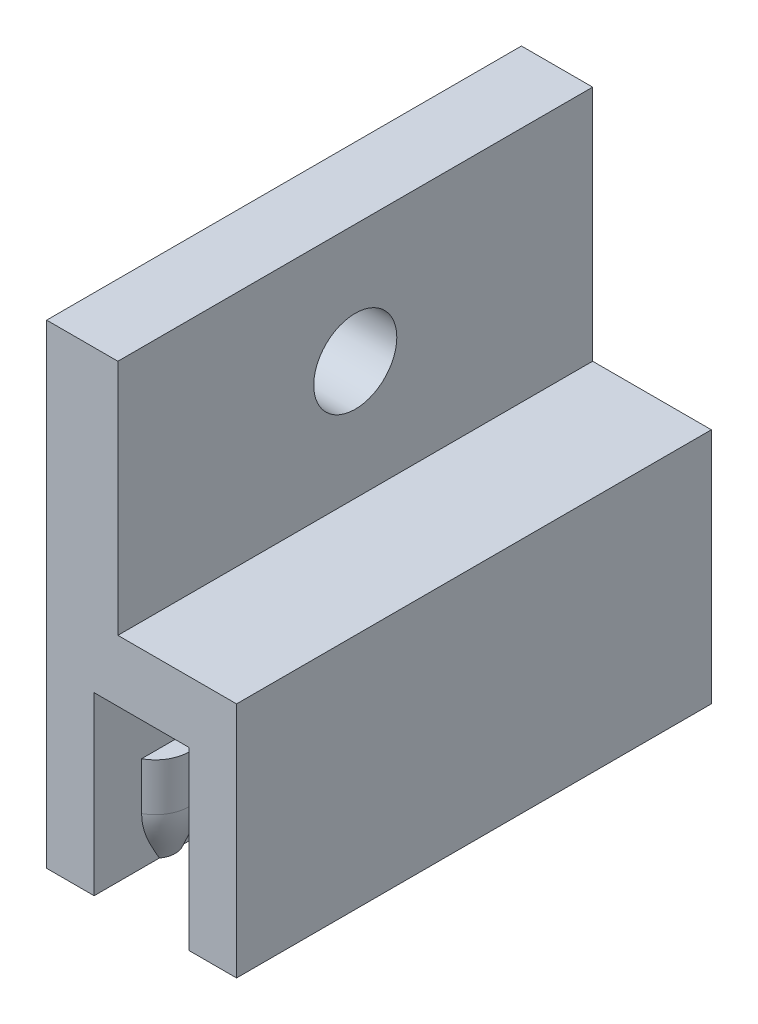
ISO-10303-21;
HEADER;
FILE_DESCRIPTION(('STEP AP214'),'2;1');
FILE_NAME('part.step','',(''),(''),'','','');
FILE_SCHEMA(('AUTOMOTIVE_DESIGN { 1 0 10303 214 1 1 1 1 }'));
ENDSEC;
DATA;
#1=APPLICATION_CONTEXT('core data for automotive mechanical design processes');
#2=APPLICATION_PROTOCOL_DEFINITION('international standard','automotive_design',2000,#1);
#3=PRODUCT_CONTEXT('',#1,'mechanical');
#4=PRODUCT('Part','Part','',(#3));
#5=PRODUCT_RELATED_PRODUCT_CATEGORY('part','',(#4));
#6=PRODUCT_DEFINITION_FORMATION('','',#4);
#7=PRODUCT_DEFINITION_CONTEXT('part definition',#1,'design');
#8=PRODUCT_DEFINITION('design','',#6,#7);
#9=PRODUCT_DEFINITION_SHAPE('','',#8);
#10=(LENGTH_UNIT() NAMED_UNIT(*) SI_UNIT(.MILLI.,.METRE.));
#11=(NAMED_UNIT(*) PLANE_ANGLE_UNIT() SI_UNIT($,.RADIAN.));
#12=(NAMED_UNIT(*) SI_UNIT($,.STERADIAN.) SOLID_ANGLE_UNIT());
#13=UNCERTAINTY_MEASURE_WITH_UNIT(LENGTH_MEASURE(1.E-05),#10,'distance_accuracy_value','');
#14=(GEOMETRIC_REPRESENTATION_CONTEXT(3) GLOBAL_UNCERTAINTY_ASSIGNED_CONTEXT((#13)) GLOBAL_UNIT_ASSIGNED_CONTEXT((#10,
#11,#12)) REPRESENTATION_CONTEXT('',''));
#15=CARTESIAN_POINT('',(0.,0.,0.));
#16=DIRECTION('',(0.,0.,1.));
#17=DIRECTION('',(1.,0.,0.));
#18=AXIS2_PLACEMENT_3D('',#15,#16,#17);
#19=CARTESIAN_POINT('',(0.,0.,20.));
#20=DIRECTION('',(-1.,0.,0.));
#21=DIRECTION('',(0.,0.,1.));
#22=AXIS2_PLACEMENT_3D('',#19,#20,#21);
#23=PLANE('',#22);
#24=DIRECTION('',(0.,1.,0.));
#25=VECTOR('',#24,1.);
#26=CARTESIAN_POINT('',(0.,0.,0.));
#27=LINE('',#26,#25);
#28=CARTESIAN_POINT('',(0.,0.,0.));
#29=VERTEX_POINT('',#28);
#30=CARTESIAN_POINT('',(0.,7.40971508067067,0.));
#31=VERTEX_POINT('',#30);
#32=EDGE_CURVE('E251',#29,#31,#27,.T.);
#33=ORIENTED_EDGE('',*,*,#32,.T.);
#34=CARTESIAN_POINT('',(0.,-77.,10.));
#35=DIRECTION('',(-1.,0.,0.));
#36=DIRECTION('',(0.,0.,1.));
#37=AXIS2_PLACEMENT_3D('',#34,#35,#36);
#38=CIRCLE('',#37,85.);
#39=CARTESIAN_POINT('',(0.,7.40971508067067,20.));
#40=VERTEX_POINT('',#39);
#41=EDGE_CURVE('E185',#40,#31,#38,.T.);
#42=ORIENTED_EDGE('',*,*,#41,.F.);
#43=DIRECTION('',(0.,1.,0.));
#44=VECTOR('',#43,1.);
#45=CARTESIAN_POINT('',(0.,0.,20.));
#46=LINE('',#45,#44);
#47=CARTESIAN_POINT('',(0.,0.,20.));
#48=VERTEX_POINT('',#47);
#49=EDGE_CURVE('E202',#48,#40,#46,.T.);
#50=ORIENTED_EDGE('',*,*,#49,.F.);
#51=DIRECTION('',(0.,0.,-1.));
#52=VECTOR('',#51,1.);
#53=CARTESIAN_POINT('',(0.,0.,20.));
#54=LINE('',#53,#52);
#55=CARTESIAN_POINT('',(0.,0.,17.25));
#56=VERTEX_POINT('',#55);
#57=EDGE_CURVE('E240',#48,#56,#54,.T.);
#58=ORIENTED_EDGE('',*,*,#57,.T.);
#59=CARTESIAN_POINT('',(0.,2.,18.));
#60=CARTESIAN_POINT('',(0.,1.28799968789021,18.));
#61=CARTESIAN_POINT('',(0.,0.643999843945103,17.625));
#62=CARTESIAN_POINT('',(0.,0.,17.25));
#63=B_SPLINE_CURVE_WITH_KNOTS('',3,(#59,#60,#61,#62),.UNSPECIFIED.,.F.,.F.,(4,4),(0.,1.),.UNSPECIFIED.);
#64=CARTESIAN_POINT('',(0.,2.,18.));
#65=VERTEX_POINT('',#64);
#66=EDGE_CURVE('E345',#65,#56,#63,.T.);
#67=ORIENTED_EDGE('',*,*,#66,.F.);
#68=DIRECTION('',(0.,-1.,0.));
#69=VECTOR('',#68,1.);
#70=CARTESIAN_POINT('',(0.,4.,18.));
#71=LINE('',#70,#69);
#72=CARTESIAN_POINT('',(0.,4.,18.));
#73=VERTEX_POINT('',#72);
#74=EDGE_CURVE('E262',#73,#65,#71,.T.);
#75=ORIENTED_EDGE('',*,*,#74,.F.);
#76=DIRECTION('',(0.,0.,-1.));
#77=VECTOR('',#76,1.);
#78=CARTESIAN_POINT('',(0.,4.,18.));
#79=LINE('',#78,#77);
#80=CARTESIAN_POINT('',(0.,4.,15.5));
#81=VERTEX_POINT('',#80);
#82=EDGE_CURVE('E266',#73,#81,#79,.T.);
#83=ORIENTED_EDGE('',*,*,#82,.T.);
#84=DIRECTION('',(0.,-1.,0.));
#85=VECTOR('',#84,1.);
#86=CARTESIAN_POINT('',(0.,4.,15.5));
#87=LINE('',#86,#85);
#88=CARTESIAN_POINT('',(0.,2.,15.5));
#89=VERTEX_POINT('',#88);
#90=EDGE_CURVE('E265',#81,#89,#87,.T.);
#91=ORIENTED_EDGE('',*,*,#90,.T.);
#92=CARTESIAN_POINT('',(0.,0.,16.25));
#93=CARTESIAN_POINT('',(0.,0.643999843945103,15.875));
#94=CARTESIAN_POINT('',(0.,1.28799968789021,15.5));
#95=CARTESIAN_POINT('',(0.,2.,15.5));
#96=B_SPLINE_CURVE_WITH_KNOTS('',3,(#92,#93,#94,#95),.UNSPECIFIED.,.F.,.F.,(4,4),(0.,1.),.UNSPECIFIED.);
#97=CARTESIAN_POINT('',(0.,0.,16.25));
#98=VERTEX_POINT('',#97);
#99=EDGE_CURVE('E347',#98,#89,#96,.T.);
#100=ORIENTED_EDGE('',*,*,#99,.F.);
#101=CARTESIAN_POINT('',(0.,0.,3.75));
#102=VERTEX_POINT('',#101);
#103=EDGE_CURVE('E235',#98,#102,#54,.T.);
#104=ORIENTED_EDGE('',*,*,#103,.T.);
#105=CARTESIAN_POINT('',(0.,2.,4.5));
#106=CARTESIAN_POINT('',(0.,1.28799968789021,4.5));
#107=CARTESIAN_POINT('',(0.,0.643999843945103,4.125));
#108=CARTESIAN_POINT('',(0.,0.,3.75));
#109=B_SPLINE_CURVE_WITH_KNOTS('',3,(#105,#106,#107,#108),.UNSPECIFIED.,.F.,.F.,(4,4),(0.,1.),.UNSPECIFIED.);
#110=CARTESIAN_POINT('',(0.,2.,4.5));
#111=VERTEX_POINT('',#110);
#112=EDGE_CURVE('E178',#111,#102,#109,.T.);
#113=ORIENTED_EDGE('',*,*,#112,.F.);
#114=DIRECTION('',(0.,-1.,0.));
#115=VECTOR('',#114,1.);
#116=CARTESIAN_POINT('',(0.,4.,4.5));
#117=LINE('',#116,#115);
#118=CARTESIAN_POINT('',(0.,4.,4.5));
#119=VERTEX_POINT('',#118);
#120=EDGE_CURVE('E415',#119,#111,#117,.T.);
#121=ORIENTED_EDGE('',*,*,#120,.F.);
#122=DIRECTION('',(0.,0.,-1.));
#123=VECTOR('',#122,1.);
#124=CARTESIAN_POINT('',(0.,4.,2.));
#125=LINE('',#124,#123);
#126=CARTESIAN_POINT('',(0.,4.,2.));
#127=VERTEX_POINT('',#126);
#128=EDGE_CURVE('E411',#119,#127,#125,.T.);
#129=ORIENTED_EDGE('',*,*,#128,.T.);
#130=DIRECTION('',(0.,-1.,0.));
#131=VECTOR('',#130,1.);
#132=CARTESIAN_POINT('',(0.,4.,2.));
#133=LINE('',#132,#131);
#134=CARTESIAN_POINT('',(0.,2.,2.));
#135=VERTEX_POINT('',#134);
#136=EDGE_CURVE('E511',#127,#135,#133,.T.);
#137=ORIENTED_EDGE('',*,*,#136,.T.);
#138=CARTESIAN_POINT('',(0.,0.,2.75));
#139=CARTESIAN_POINT('',(0.,0.643999843945103,2.375));
#140=CARTESIAN_POINT('',(0.,1.28799968789021,2.));
#141=CARTESIAN_POINT('',(0.,2.,2.));
#142=B_SPLINE_CURVE_WITH_KNOTS('',3,(#138,#139,#140,#141),.UNSPECIFIED.,.F.,.F.,(4,4),(0.,1.),.UNSPECIFIED.);
#143=CARTESIAN_POINT('',(0.,0.,2.75));
#144=VERTEX_POINT('',#143);
#145=EDGE_CURVE('E346',#144,#135,#142,.T.);
#146=ORIENTED_EDGE('',*,*,#145,.F.);
#147=EDGE_CURVE('E232',#144,#29,#54,.T.);
#148=ORIENTED_EDGE('',*,*,#147,.T.);
#149=EDGE_LOOP('',(#33,#42,#50,#58,#67,#75,#83,#91,#100,#104,#113,#121,#129,#137,#146,#148));
#150=FACE_BOUND('',#149,.T.);
#151=ADVANCED_FACE('F51',(#150),#23,.F.);
#152=CARTESIAN_POINT('',(4.,8.,20.));
#153=DIRECTION('',(1.,0.,0.));
#154=DIRECTION('',(0.,1.,0.));
#155=AXIS2_PLACEMENT_3D('',#152,#153,#154);
#156=PLANE('',#155);
#157=CARTESIAN_POINT('',(4.0000000000191,-77.,10.));
#158=DIRECTION('',(1.,0.,0.));
#159=DIRECTION('',(0.,1.,0.));
#160=AXIS2_PLACEMENT_3D('',#157,#158,#159);
#161=CIRCLE('',#160,85.);
#162=CARTESIAN_POINT('',(4.00000000013279,7.40971508067067,20.));
#163=VERTEX_POINT('',#162);
#164=CARTESIAN_POINT('',(4.00000000013279,7.40971508067067,0.));
#165=VERTEX_POINT('',#164);
#166=EDGE_CURVE('E170',#163,#165,#161,.F.);
#167=ORIENTED_EDGE('',*,*,#166,.T.);
#168=DIRECTION('',(0.,-1.,0.));
#169=VECTOR('',#168,1.);
#170=CARTESIAN_POINT('',(4.,8.,0.));
#171=LINE('',#170,#169);
#172=CARTESIAN_POINT('',(4.,0.,0.));
#173=VERTEX_POINT('',#172);
#174=EDGE_CURVE('E174',#165,#173,#171,.T.);
#175=ORIENTED_EDGE('',*,*,#174,.T.);
#176=DIRECTION('',(0.,0.,-1.));
#177=VECTOR('',#176,1.);
#178=CARTESIAN_POINT('',(4.,0.,20.));
#179=LINE('',#178,#177);
#180=CARTESIAN_POINT('',(4.,0.,20.));
#181=VERTEX_POINT('',#180);
#182=EDGE_CURVE('E12',#181,#173,#179,.T.);
#183=ORIENTED_EDGE('',*,*,#182,.F.);
#184=DIRECTION('',(0.,-1.,0.));
#185=VECTOR('',#184,1.);
#186=CARTESIAN_POINT('',(4.,8.,20.));
#187=LINE('',#186,#185);
#188=EDGE_CURVE('E175',#163,#181,#187,.T.);
#189=ORIENTED_EDGE('',*,*,#188,.F.);
#190=EDGE_LOOP('',(#167,#175,#183,#189));
#191=FACE_BOUND('',#190,.T.);
#192=ADVANCED_FACE('F53',(#191),#156,.F.);
#193=CARTESIAN_POINT('',(6.,0.,20.));
#194=DIRECTION('',(0.,-1.,0.));
#195=DIRECTION('',(0.,0.,-1.));
#196=AXIS2_PLACEMENT_3D('',#193,#194,#195);
#197=PLANE('',#196);
#198=DIRECTION('',(-1.,0.,0.));
#199=VECTOR('',#198,1.);
#200=CARTESIAN_POINT('',(6.,0.,0.));
#201=LINE('',#200,#199);
#202=CARTESIAN_POINT('',(6.,0.,0.));
#203=VERTEX_POINT('',#202);
#204=EDGE_CURVE('E194',#203,#173,#201,.T.);
#205=ORIENTED_EDGE('',*,*,#204,.F.);
#206=DIRECTION('',(0.,0.,-1.));
#207=VECTOR('',#206,1.);
#208=CARTESIAN_POINT('',(6.,0.,20.));
#209=LINE('',#208,#207);
#210=CARTESIAN_POINT('',(6.,0.,20.));
#211=VERTEX_POINT('',#210);
#212=EDGE_CURVE('E62',#211,#203,#209,.T.);
#213=ORIENTED_EDGE('',*,*,#212,.F.);
#214=DIRECTION('',(-1.,0.,0.));
#215=VECTOR('',#214,1.);
#216=CARTESIAN_POINT('',(6.,0.,20.));
#217=LINE('',#216,#215);
#218=EDGE_CURVE('E376',#211,#181,#217,.T.);
#219=ORIENTED_EDGE('',*,*,#218,.T.);
#220=ORIENTED_EDGE('',*,*,#182,.T.);
#221=EDGE_LOOP('',(#205,#213,#219,#220));
#222=FACE_BOUND('',#221,.T.);
#223=ADVANCED_FACE('F390',(#222),#197,.T.);
#224=CARTESIAN_POINT('',(6.,8.,20.));
#225=DIRECTION('',(1.,0.,0.));
#226=DIRECTION('',(0.,1.,0.));
#227=AXIS2_PLACEMENT_3D('',#224,#225,#226);
#228=PLANE('',#227);
#229=DIRECTION('',(0.,-1.,0.));
#230=VECTOR('',#229,1.);
#231=CARTESIAN_POINT('',(6.,8.,0.));
#232=LINE('',#231,#230);
#233=CARTESIAN_POINT('',(6.,10.,0.));
#234=VERTEX_POINT('',#233);
#235=EDGE_CURVE('E197',#234,#203,#232,.T.);
#236=ORIENTED_EDGE('',*,*,#235,.F.);
#237=DIRECTION('',(0.,0.,-1.));
#238=VECTOR('',#237,1.);
#239=CARTESIAN_POINT('',(6.,10.,20.));
#240=LINE('',#239,#238);
#241=CARTESIAN_POINT('',(6.,10.,20.));
#242=VERTEX_POINT('',#241);
#243=EDGE_CURVE('E387',#242,#234,#240,.T.);
#244=ORIENTED_EDGE('',*,*,#243,.F.);
#245=DIRECTION('',(0.,-1.,0.));
#246=VECTOR('',#245,1.);
#247=CARTESIAN_POINT('',(6.,8.,20.));
#248=LINE('',#247,#246);
#249=EDGE_CURVE('E218',#242,#211,#248,.T.);
#250=ORIENTED_EDGE('',*,*,#249,.T.);
#251=ORIENTED_EDGE('',*,*,#212,.T.);
#252=EDGE_LOOP('',(#236,#244,#250,#251));
#253=FACE_BOUND('',#252,.T.);
#254=ADVANCED_FACE('F385',(#253),#228,.T.);
#255=CARTESIAN_POINT('',(0.,10.,20.));
#256=DIRECTION('',(0.,1.,0.));
#257=DIRECTION('',(0.,0.,1.));
#258=AXIS2_PLACEMENT_3D('',#255,#256,#257);
#259=PLANE('',#258);
#260=DIRECTION('',(0.,0.,-1.));
#261=VECTOR('',#260,1.);
#262=CARTESIAN_POINT('',(1.,10.,20.));
#263=LINE('',#262,#261);
#264=CARTESIAN_POINT('',(1.,10.,20.));
#265=VERTEX_POINT('',#264);
#266=CARTESIAN_POINT('',(1.,10.,0.));
#267=VERTEX_POINT('',#266);
#268=EDGE_CURVE('E219',#265,#267,#263,.T.);
#269=ORIENTED_EDGE('',*,*,#268,.F.);
#270=DIRECTION('',(1.,0.,0.));
#271=VECTOR('',#270,1.);
#272=CARTESIAN_POINT('',(0.,10.,20.));
#273=LINE('',#272,#271);
#274=EDGE_CURVE('E214',#265,#242,#273,.T.);
#275=ORIENTED_EDGE('',*,*,#274,.T.);
#276=ORIENTED_EDGE('',*,*,#243,.T.);
#277=DIRECTION('',(1.,0.,0.));
#278=VECTOR('',#277,1.);
#279=CARTESIAN_POINT('',(0.,10.,0.));
#280=LINE('',#279,#278);
#281=EDGE_CURVE('E206',#267,#234,#280,.T.);
#282=ORIENTED_EDGE('',*,*,#281,.F.);
#283=EDGE_LOOP('',(#269,#275,#276,#282));
#284=FACE_BOUND('',#283,.T.);
#285=ADVANCED_FACE('F395',(#284),#259,.T.);
#286=CARTESIAN_POINT('',(-2.,0.,20.));
#287=DIRECTION('',(-1.,0.,0.));
#288=DIRECTION('',(0.,0.,1.));
#289=AXIS2_PLACEMENT_3D('',#286,#287,#288);
#290=PLANE('',#289);
#291=CARTESIAN_POINT('',(-2.,15.,10.));
#292=DIRECTION('',(1.,0.,0.));
#293=DIRECTION('',(0.,0.,-1.));
#294=AXIS2_PLACEMENT_3D('',#291,#292,#293);
#295=CIRCLE('',#294,1.75);
#296=CARTESIAN_POINT('',(-2.,15.,8.25));
#297=VERTEX_POINT('',#296);
#298=EDGE_CURVE('E400',#297,#297,#295,.T.);
#299=ORIENTED_EDGE('',*,*,#298,.T.);
#300=EDGE_LOOP('',(#299));
#301=FACE_BOUND('',#300,.T.);
#302=DIRECTION('',(0.,1.,0.));
#303=VECTOR('',#302,1.);
#304=CARTESIAN_POINT('',(-2.,0.,0.));
#305=LINE('',#304,#303);
#306=CARTESIAN_POINT('',(-2.,0.,0.));
#307=VERTEX_POINT('',#306);
#308=CARTESIAN_POINT('',(-2.,20.,0.));
#309=VERTEX_POINT('',#308);
#310=EDGE_CURVE('E209',#307,#309,#305,.T.);
#311=ORIENTED_EDGE('',*,*,#310,.F.);
#312=DIRECTION('',(0.,0.,-1.));
#313=VECTOR('',#312,1.);
#314=CARTESIAN_POINT('',(-2.,0.,20.));
#315=LINE('',#314,#313);
#316=CARTESIAN_POINT('',(-2.,0.,20.));
#317=VERTEX_POINT('',#316);
#318=EDGE_CURVE('E252',#317,#307,#315,.T.);
#319=ORIENTED_EDGE('',*,*,#318,.F.);
#320=DIRECTION('',(0.,1.,0.));
#321=VECTOR('',#320,1.);
#322=CARTESIAN_POINT('',(-2.,0.,20.));
#323=LINE('',#322,#321);
#324=CARTESIAN_POINT('',(-2.,20.,20.));
#325=VERTEX_POINT('',#324);
#326=EDGE_CURVE('E217',#317,#325,#323,.T.);
#327=ORIENTED_EDGE('',*,*,#326,.T.);
#328=DIRECTION('',(0.,0.,-1.));
#329=VECTOR('',#328,1.);
#330=CARTESIAN_POINT('',(-2.,20.,20.));
#331=LINE('',#330,#329);
#332=EDGE_CURVE('E199',#325,#309,#331,.T.);
#333=ORIENTED_EDGE('',*,*,#332,.T.);
#334=EDGE_LOOP('',(#311,#319,#327,#333));
#335=FACE_BOUND('',#334,.T.);
#336=ADVANCED_FACE('F367',(#301,#335),#290,.T.);
#337=CARTESIAN_POINT('',(0.,0.,20.));
#338=DIRECTION('',(0.,-1.,0.));
#339=DIRECTION('',(0.,0.,-1.));
#340=AXIS2_PLACEMENT_3D('',#337,#338,#339);
#341=PLANE('',#340);
#342=DIRECTION('',(-1.,0.,0.));
#343=VECTOR('',#342,1.);
#344=CARTESIAN_POINT('',(0.,0.,0.));
#345=LINE('',#344,#343);
#346=EDGE_CURVE('E397',#29,#307,#345,.T.);
#347=ORIENTED_EDGE('',*,*,#346,.F.);
#348=ORIENTED_EDGE('',*,*,#147,.F.);
#349=CARTESIAN_POINT('',(0.,0.,3.75));
#350=CARTESIAN_POINT('',(0.111076570808846,0.,3.60189790558821));
#351=CARTESIAN_POINT('',(0.166614856213268,0.,3.4259489527941));
#352=CARTESIAN_POINT('',(0.166614856213268,0.,3.0740510472059));
#353=CARTESIAN_POINT('',(0.111076570808846,0.,2.89810209441179));
#354=CARTESIAN_POINT('',(0.,0.,2.75));
#355=B_SPLINE_CURVE_WITH_KNOTS('',3,(#349,#350,#351,#352,#353,#354),.UNSPECIFIED.,.F.,.F.,(4,2,
4),(0.,0.5,1.),.UNSPECIFIED.);
#356=EDGE_CURVE('E70',#144,#102,#355,.F.);
#357=ORIENTED_EDGE('',*,*,#356,.T.);
#358=ORIENTED_EDGE('',*,*,#103,.F.);
#359=CARTESIAN_POINT('',(0.,0.,17.25));
#360=CARTESIAN_POINT('',(0.111076570808846,0.,17.1018979055882));
#361=CARTESIAN_POINT('',(0.166614856213268,0.,16.9259489527941));
#362=CARTESIAN_POINT('',(0.166614856213268,0.,16.5740510472059));
#363=CARTESIAN_POINT('',(0.111076570808846,0.,16.3981020944118));
#364=CARTESIAN_POINT('',(0.,0.,16.25));
#365=B_SPLINE_CURVE_WITH_KNOTS('',3,(#359,#360,#361,#362,#363,#364),.UNSPECIFIED.,.F.,.F.,(4,2,
4),(0.,0.5,1.),.UNSPECIFIED.);
#366=EDGE_CURVE('E79',#98,#56,#365,.F.);
#367=ORIENTED_EDGE('',*,*,#366,.T.);
#368=ORIENTED_EDGE('',*,*,#57,.F.);
#369=DIRECTION('',(-1.,0.,0.));
#370=VECTOR('',#369,1.);
#371=CARTESIAN_POINT('',(0.,0.,20.));
#372=LINE('',#371,#370);
#373=EDGE_CURVE('E227',#48,#317,#372,.T.);
#374=ORIENTED_EDGE('',*,*,#373,.T.);
#375=ORIENTED_EDGE('',*,*,#318,.T.);
#376=EDGE_LOOP('',(#347,#348,#357,#358,#367,#368,#374,#375));
#377=FACE_BOUND('',#376,.T.);
#378=ADVANCED_FACE('F306',(#377),#341,.T.);
#379=CARTESIAN_POINT('',(4.,0.,20.));
#380=DIRECTION('',(0.,0.,-1.));
#381=DIRECTION('',(-1.,0.,0.));
#382=AXIS2_PLACEMENT_3D('',#379,#380,#381);
#383=PLANE('',#382);
#384=DIRECTION('',(-1.,0.,0.));
#385=VECTOR('',#384,1.);
#386=CARTESIAN_POINT('',(500000.,7.40971508067067,20.));
#387=LINE('',#386,#385);
#388=EDGE_CURVE('E179',#163,#40,#387,.T.);
#389=ORIENTED_EDGE('',*,*,#388,.F.);
#390=ORIENTED_EDGE('',*,*,#188,.T.);
#391=ORIENTED_EDGE('',*,*,#218,.F.);
#392=ORIENTED_EDGE('',*,*,#249,.F.);
#393=ORIENTED_EDGE('',*,*,#274,.F.);
#394=DIRECTION('',(0.,1.,0.));
#395=VECTOR('',#394,1.);
#396=CARTESIAN_POINT('',(1.,10.,20.));
#397=LINE('',#396,#395);
#398=CARTESIAN_POINT('',(1.,20.,20.));
#399=VERTEX_POINT('',#398);
#400=EDGE_CURVE('E398',#265,#399,#397,.T.);
#401=ORIENTED_EDGE('',*,*,#400,.T.);
#402=DIRECTION('',(1.,0.,0.));
#403=VECTOR('',#402,1.);
#404=CARTESIAN_POINT('',(-2.,20.,20.));
#405=LINE('',#404,#403);
#406=EDGE_CURVE('E362',#325,#399,#405,.T.);
#407=ORIENTED_EDGE('',*,*,#406,.F.);
#408=ORIENTED_EDGE('',*,*,#326,.F.);
#409=ORIENTED_EDGE('',*,*,#373,.F.);
#410=ORIENTED_EDGE('',*,*,#49,.T.);
#411=EDGE_LOOP('',(#389,#390,#391,#392,#393,#401,#407,#408,#409,#410));
#412=FACE_BOUND('',#411,.T.);
#413=ADVANCED_FACE('F303',(#412),#383,.F.);
#414=CARTESIAN_POINT('',(4.,0.,0.));
#415=DIRECTION('',(0.,0.,-1.));
#416=DIRECTION('',(-1.,0.,0.));
#417=AXIS2_PLACEMENT_3D('',#414,#415,#416);
#418=PLANE('',#417);
#419=ORIENTED_EDGE('',*,*,#174,.F.);
#420=DIRECTION('',(-1.,0.,0.));
#421=VECTOR('',#420,1.);
#422=CARTESIAN_POINT('',(500000.,7.40971508067067,0.));
#423=LINE('',#422,#421);
#424=EDGE_CURVE('E182',#165,#31,#423,.T.);
#425=ORIENTED_EDGE('',*,*,#424,.T.);
#426=ORIENTED_EDGE('',*,*,#32,.F.);
#427=ORIENTED_EDGE('',*,*,#346,.T.);
#428=ORIENTED_EDGE('',*,*,#310,.T.);
#429=DIRECTION('',(1.,0.,0.));
#430=VECTOR('',#429,1.);
#431=CARTESIAN_POINT('',(-2.,20.,0.));
#432=LINE('',#431,#430);
#433=CARTESIAN_POINT('',(1.,20.,0.));
#434=VERTEX_POINT('',#433);
#435=EDGE_CURVE('E370',#309,#434,#432,.T.);
#436=ORIENTED_EDGE('',*,*,#435,.T.);
#437=DIRECTION('',(0.,1.,0.));
#438=VECTOR('',#437,1.);
#439=CARTESIAN_POINT('',(1.,10.,0.));
#440=LINE('',#439,#438);
#441=EDGE_CURVE('E393',#267,#434,#440,.T.);
#442=ORIENTED_EDGE('',*,*,#441,.F.);
#443=ORIENTED_EDGE('',*,*,#281,.T.);
#444=ORIENTED_EDGE('',*,*,#235,.T.);
#445=ORIENTED_EDGE('',*,*,#204,.T.);
#446=EDGE_LOOP('',(#419,#425,#426,#427,#428,#436,#442,#443,#444,#445));
#447=FACE_BOUND('',#446,.T.);
#448=ADVANCED_FACE('F191',(#447),#418,.T.);
#449=CARTESIAN_POINT('',(1.,10.,20.));
#450=DIRECTION('',(-1.,0.,0.));
#451=DIRECTION('',(0.,0.,1.));
#452=AXIS2_PLACEMENT_3D('',#449,#450,#451);
#453=PLANE('',#452);
#454=CARTESIAN_POINT('',(1.,15.,10.));
#455=DIRECTION('',(1.,0.,0.));
#456=DIRECTION('',(0.,0.,-1.));
#457=AXIS2_PLACEMENT_3D('',#454,#455,#456);
#458=CIRCLE('',#457,1.75);
#459=CARTESIAN_POINT('',(1.,15.,8.25));
#460=VERTEX_POINT('',#459);
#461=EDGE_CURVE('E271',#460,#460,#458,.T.);
#462=ORIENTED_EDGE('',*,*,#461,.F.);
#463=EDGE_LOOP('',(#462));
#464=FACE_BOUND('',#463,.T.);
#465=ORIENTED_EDGE('',*,*,#441,.T.);
#466=DIRECTION('',(0.,0.,-1.));
#467=VECTOR('',#466,1.);
#468=CARTESIAN_POINT('',(1.,20.,20.));
#469=LINE('',#468,#467);
#470=EDGE_CURVE('E195',#399,#434,#469,.T.);
#471=ORIENTED_EDGE('',*,*,#470,.F.);
#472=ORIENTED_EDGE('',*,*,#400,.F.);
#473=ORIENTED_EDGE('',*,*,#268,.T.);
#474=EDGE_LOOP('',(#465,#471,#472,#473));
#475=FACE_BOUND('',#474,.T.);
#476=ADVANCED_FACE('F298',(#464,#475),#453,.F.);
#477=CARTESIAN_POINT('',(-2.,20.,20.));
#478=DIRECTION('',(0.,1.,0.));
#479=DIRECTION('',(0.,0.,1.));
#480=AXIS2_PLACEMENT_3D('',#477,#478,#479);
#481=PLANE('',#480);
#482=ORIENTED_EDGE('',*,*,#435,.F.);
#483=ORIENTED_EDGE('',*,*,#332,.F.);
#484=ORIENTED_EDGE('',*,*,#406,.T.);
#485=ORIENTED_EDGE('',*,*,#470,.T.);
#486=EDGE_LOOP('',(#482,#483,#484,#485));
#487=FACE_BOUND('',#486,.T.);
#488=ADVANCED_FACE('F294',(#487),#481,.T.);
#489=CARTESIAN_POINT('',(-2.,15.,10.));
#490=DIRECTION('',(1.,0.,0.));
#491=DIRECTION('',(0.,0.,-1.));
#492=AXIS2_PLACEMENT_3D('',#489,#490,#491);
#493=CYLINDRICAL_SURFACE('',#492,1.75);
#494=ORIENTED_EDGE('',*,*,#298,.F.);
#495=EDGE_LOOP('',(#494));
#496=FACE_BOUND('',#495,.T.);
#497=ORIENTED_EDGE('',*,*,#461,.T.);
#498=EDGE_LOOP('',(#497));
#499=FACE_BOUND('',#498,.T.);
#500=ADVANCED_FACE('F289',(#496,#499),#493,.F.);
#501=CARTESIAN_POINT('',(-0.666666666666666,4.,16.75));
#502=DIRECTION('',(0.,-1.,0.));
#503=DIRECTION('',(0.,0.,-1.));
#504=AXIS2_PLACEMENT_3D('',#501,#502,#503);
#505=CYLINDRICAL_SURFACE('',#504,1.41666666666667);
#506=CARTESIAN_POINT('',(0.,2.,15.5));
#507=CARTESIAN_POINT('',(0.461566259649048,2.,15.7461686718128));
#508=CARTESIAN_POINT('',(0.75,2.,16.2268915723977));
#509=CARTESIAN_POINT('',(0.750000000000001,2.,17.2731084276023));
#510=CARTESIAN_POINT('',(0.461566259649049,2.,17.7538313281872));
#511=CARTESIAN_POINT('',(0.,2.,18.));
#512=B_SPLINE_CURVE_WITH_KNOTS('',3,(#506,#507,#508,#509,#510,#511),.UNSPECIFIED.,.F.,.F.,(4,2,
4),(0.,0.5,1.),.UNSPECIFIED.);
#513=EDGE_CURVE('E354',#89,#65,#512,.T.);
#514=ORIENTED_EDGE('',*,*,#513,.F.);
#515=ORIENTED_EDGE('',*,*,#90,.F.);
#516=CARTESIAN_POINT('',(-0.666666666666666,4.,16.75));
#517=DIRECTION('',(0.,-1.,0.));
#518=DIRECTION('',(0.,0.,1.));
#519=AXIS2_PLACEMENT_3D('',#516,#517,#518);
#520=CIRCLE('',#519,1.41666666666667);
#521=EDGE_CURVE('E408',#81,#73,#520,.T.);
#522=ORIENTED_EDGE('',*,*,#521,.T.);
#523=ORIENTED_EDGE('',*,*,#74,.T.);
#524=EDGE_LOOP('',(#514,#515,#522,#523));
#525=FACE_BOUND('',#524,.T.);
#526=ADVANCED_FACE('F278',(#525),#505,.T.);
#527=CARTESIAN_POINT('',(-0.666666666666666,4.,16.75));
#528=DIRECTION('',(0.,1.,0.));
#529=DIRECTION('',(0.,0.,1.));
#530=AXIS2_PLACEMENT_3D('',#527,#528,#529);
#531=PLANE('',#530);
#532=ORIENTED_EDGE('',*,*,#521,.F.);
#533=ORIENTED_EDGE('',*,*,#82,.F.);
#534=EDGE_LOOP('',(#532,#533));
#535=FACE_BOUND('',#534,.T.);
#536=ADVANCED_FACE('F288',(#535),#531,.T.);
#537=CARTESIAN_POINT('',(-0.666666666666666,4.,3.25));
#538=DIRECTION('',(0.,-1.,0.));
#539=DIRECTION('',(0.,0.,-1.));
#540=AXIS2_PLACEMENT_3D('',#537,#538,#539);
#541=CYLINDRICAL_SURFACE('',#540,1.41666666666667);
#542=CARTESIAN_POINT('',(0.,2.,2.));
#543=CARTESIAN_POINT('',(0.461566259649048,2.,2.24616867181282));
#544=CARTESIAN_POINT('',(0.75,2.,2.72689157239774));
#545=CARTESIAN_POINT('',(0.750000000000001,2.,3.77310842760225));
#546=CARTESIAN_POINT('',(0.461566259649049,2.,4.25383132818717));
#547=CARTESIAN_POINT('',(0.,2.,4.5));
#548=B_SPLINE_CURVE_WITH_KNOTS('',3,(#542,#543,#544,#545,#546,#547),.UNSPECIFIED.,.F.,.F.,(4,2,
4),(0.,0.5,1.),.UNSPECIFIED.);
#549=EDGE_CURVE('E350',#135,#111,#548,.T.);
#550=ORIENTED_EDGE('',*,*,#549,.F.);
#551=ORIENTED_EDGE('',*,*,#136,.F.);
#552=CARTESIAN_POINT('',(-0.666666666666666,4.,3.25));
#553=DIRECTION('',(0.,-1.,0.));
#554=DIRECTION('',(0.,0.,-1.));
#555=AXIS2_PLACEMENT_3D('',#552,#553,#554);
#556=CIRCLE('',#555,1.41666666666667);
#557=EDGE_CURVE('E416',#127,#119,#556,.T.);
#558=ORIENTED_EDGE('',*,*,#557,.T.);
#559=ORIENTED_EDGE('',*,*,#120,.T.);
#560=EDGE_LOOP('',(#550,#551,#558,#559));
#561=FACE_BOUND('',#560,.T.);
#562=ADVANCED_FACE('F510',(#561),#541,.T.);
#563=CARTESIAN_POINT('',(-0.666666666666666,4.,3.25));
#564=DIRECTION('',(0.,-1.,0.));
#565=DIRECTION('',(0.,0.,-1.));
#566=AXIS2_PLACEMENT_3D('',#563,#564,#565);
#567=PLANE('',#566);
#568=ORIENTED_EDGE('',*,*,#557,.F.);
#569=ORIENTED_EDGE('',*,*,#128,.F.);
#570=EDGE_LOOP('',(#568,#569));
#571=FACE_BOUND('',#570,.T.);
#572=ADVANCED_FACE('F433',(#571),#567,.F.);
#573=CARTESIAN_POINT('',(0.,0.,17.25));
#574=CARTESIAN_POINT('',(0.,0.643999843945103,17.625));
#575=CARTESIAN_POINT('',(0.,1.28799968789021,18.));
#576=CARTESIAN_POINT('',(0.,2.,18.));
#577=CARTESIAN_POINT('',(0.111076570808846,0.,17.1018979055882));
#578=CARTESIAN_POINT('',(0.286321415228947,0.648387601901384,17.4278646168877));
#579=CARTESIAN_POINT('',(0.461566259649049,1.29677520380277,17.7538313281872));
#580=CARTESIAN_POINT('',(0.461566259649049,2.,17.7538313281872));
#581=CARTESIAN_POINT('',(0.166614856213268,0.,16.9259489527941));
#582=CARTESIAN_POINT('',(0.458307428106635,0.652775359857665,17.0995286901982));
#583=CARTESIAN_POINT('',(0.750000000000001,1.30555071971533,17.2731084276023));
#584=CARTESIAN_POINT('',(0.750000000000001,2.,17.2731084276023));
#585=CARTESIAN_POINT('',(0.166614856213268,0.,16.5740510472059));
#586=CARTESIAN_POINT('',(0.458307428106634,0.652775359857665,16.4004713098018));
#587=CARTESIAN_POINT('',(0.75,1.30555071971533,16.2268915723977));
#588=CARTESIAN_POINT('',(0.75,2.,16.2268915723977));
#589=CARTESIAN_POINT('',(0.111076570808846,0.,16.3981020944118));
#590=CARTESIAN_POINT('',(0.286321415228947,0.648387601901384,16.0721353831123));
#591=CARTESIAN_POINT('',(0.461566259649048,1.29677520380277,15.7461686718128));
#592=CARTESIAN_POINT('',(0.461566259649048,2.,15.7461686718128));
#593=CARTESIAN_POINT('',(0.,0.,16.25));
#594=CARTESIAN_POINT('',(0.,0.643999843945103,15.875));
#595=CARTESIAN_POINT('',(0.,1.28799968789021,15.5));
#596=CARTESIAN_POINT('',(0.,2.,15.5));
#597=B_SPLINE_SURFACE_WITH_KNOTS('',3,3,((#573,#574,#575,#576),(#577,#578,#579,#580),(#581,#582,
#583,#584),(#585,#586,#587,#588),(#589,#590,#591,#592),(#593,#594,#595,#596)),.UNSPECIFIED.,.F.,
.F.,.F.,(4,2,4),(4,4),(0.,0.5,1.),(0.,1.),.UNSPECIFIED.);
#598=ORIENTED_EDGE('',*,*,#366,.F.);
#599=ORIENTED_EDGE('',*,*,#99,.T.);
#600=ORIENTED_EDGE('',*,*,#513,.T.);
#601=ORIENTED_EDGE('',*,*,#66,.T.);
#602=EDGE_LOOP('',(#598,#599,#600,#601));
#603=FACE_BOUND('',#602,.T.);
#604=ADVANCED_FACE('F353',(#603),#597,.T.);
#605=CARTESIAN_POINT('',(0.,0.,3.75));
#606=CARTESIAN_POINT('',(0.,0.643999843945103,4.125));
#607=CARTESIAN_POINT('',(0.,1.28799968789021,4.5));
#608=CARTESIAN_POINT('',(0.,2.,4.5));
#609=CARTESIAN_POINT('',(0.111076570808846,0.,3.60189790558821));
#610=CARTESIAN_POINT('',(0.286321415228947,0.648387601901384,3.92786461688769));
#611=CARTESIAN_POINT('',(0.461566259649049,1.29677520380277,4.25383132818717));
#612=CARTESIAN_POINT('',(0.461566259649049,2.,4.25383132818717));
#613=CARTESIAN_POINT('',(0.166614856213268,0.,3.4259489527941));
#614=CARTESIAN_POINT('',(0.458307428106635,0.652775359857665,3.59952869019818));
#615=CARTESIAN_POINT('',(0.750000000000001,1.30555071971533,3.77310842760225));
#616=CARTESIAN_POINT('',(0.750000000000001,2.,3.77310842760225));
#617=CARTESIAN_POINT('',(0.166614856213268,0.,3.0740510472059));
#618=CARTESIAN_POINT('',(0.458307428106634,0.652775359857665,2.90047130980182));
#619=CARTESIAN_POINT('',(0.75,1.30555071971533,2.72689157239774));
#620=CARTESIAN_POINT('',(0.75,2.,2.72689157239774));
#621=CARTESIAN_POINT('',(0.111076570808846,0.,2.89810209441179));
#622=CARTESIAN_POINT('',(0.286321415228947,0.648387601901384,2.57213538311231));
#623=CARTESIAN_POINT('',(0.461566259649048,1.29677520380277,2.24616867181282));
#624=CARTESIAN_POINT('',(0.461566259649048,2.,2.24616867181282));
#625=CARTESIAN_POINT('',(0.,0.,2.75));
#626=CARTESIAN_POINT('',(0.,0.643999843945103,2.375));
#627=CARTESIAN_POINT('',(0.,1.28799968789021,2.));
#628=CARTESIAN_POINT('',(0.,2.,2.));
#629=B_SPLINE_SURFACE_WITH_KNOTS('',3,3,((#605,#606,#607,#608),(#609,#610,#611,#612),(#613,#614,
#615,#616),(#617,#618,#619,#620),(#621,#622,#623,#624),(#625,#626,#627,#628)),.UNSPECIFIED.,.F.,
.F.,.F.,(4,2,4),(4,4),(0.,0.5,1.),(0.,1.),.UNSPECIFIED.);
#630=ORIENTED_EDGE('',*,*,#356,.F.);
#631=ORIENTED_EDGE('',*,*,#145,.T.);
#632=ORIENTED_EDGE('',*,*,#549,.T.);
#633=ORIENTED_EDGE('',*,*,#112,.T.);
#634=EDGE_LOOP('',(#630,#631,#632,#633));
#635=FACE_BOUND('',#634,.T.);
#636=ADVANCED_FACE('F432',(#635),#629,.T.);
#637=CARTESIAN_POINT('',(500000.,-77.,10.));
#638=DIRECTION('',(-1.,0.,0.));
#639=DIRECTION('',(0.,0.,1.));
#640=AXIS2_PLACEMENT_3D('',#637,#638,#639);
#641=CYLINDRICAL_SURFACE('',#640,85.);
#642=ORIENTED_EDGE('',*,*,#166,.F.);
#643=ORIENTED_EDGE('',*,*,#388,.T.);
#644=ORIENTED_EDGE('',*,*,#41,.T.);
#645=ORIENTED_EDGE('',*,*,#424,.F.);
#646=EDGE_LOOP('',(#642,#643,#644,#645));
#647=FACE_BOUND('',#646,.T.);
#648=ADVANCED_FACE('F183',(#647),#641,.F.);
#649=CLOSED_SHELL('',(#151,#192,#223,#254,#285,#336,#378,#413,#448,#476,#488,#500,#526,#536,
#562,#572,#604,#636,#648));
#650=MANIFOLD_SOLID_BREP('B2',#649);
#651=ADVANCED_BREP_SHAPE_REPRESENTATION('',(#18,#650),#14);
#652=SHAPE_DEFINITION_REPRESENTATION(#9,#651);
ENDSEC;
END-ISO-10303-21;
